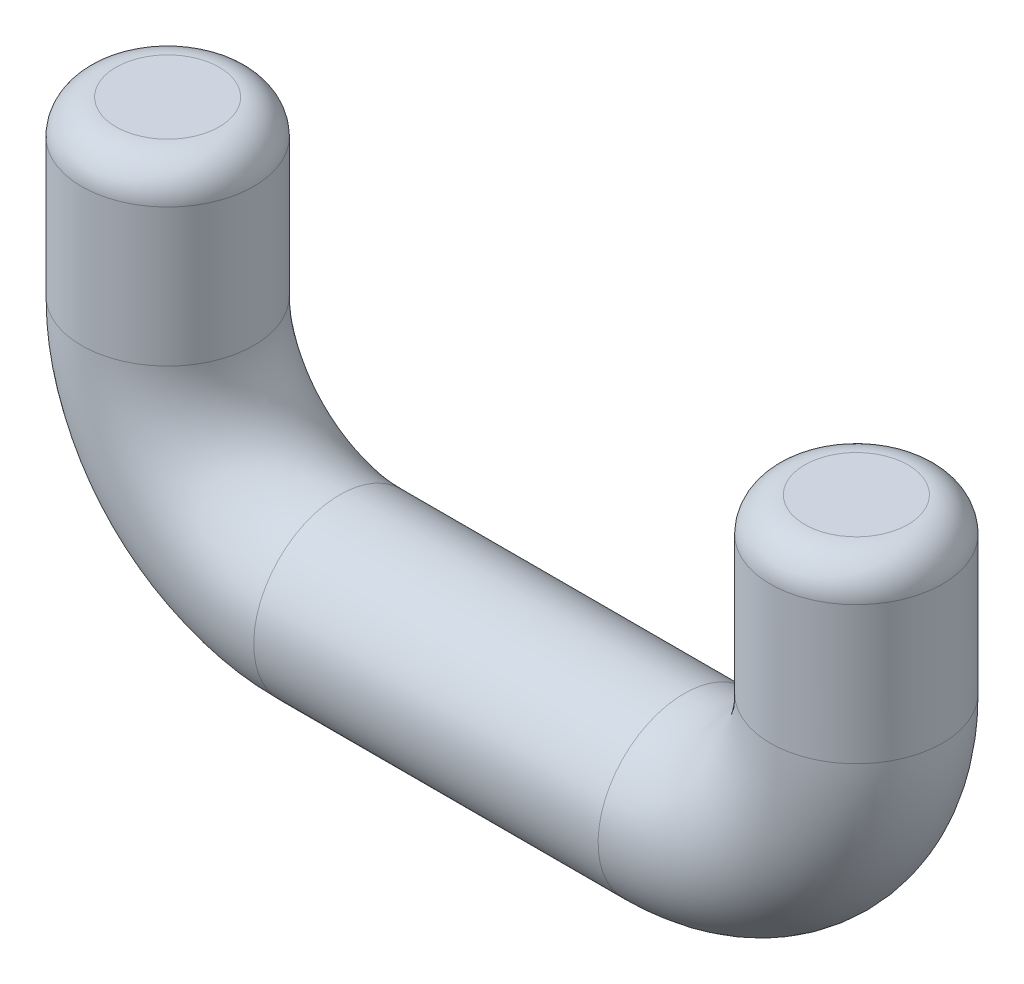
ISO-10303-21;
HEADER;
FILE_DESCRIPTION(('STEP AP214'),'2;1');
FILE_NAME('part.step','',(''),(''),'','','');
FILE_SCHEMA(('AUTOMOTIVE_DESIGN { 1 0 10303 214 1 1 1 1 }'));
ENDSEC;
DATA;
#1=APPLICATION_CONTEXT('core data for automotive mechanical design processes');
#2=APPLICATION_PROTOCOL_DEFINITION('international standard','automotive_design',2000,#1);
#3=PRODUCT_CONTEXT('',#1,'mechanical');
#4=PRODUCT('Part','Part','',(#3));
#5=PRODUCT_RELATED_PRODUCT_CATEGORY('part','',(#4));
#6=PRODUCT_DEFINITION_FORMATION('','',#4);
#7=PRODUCT_DEFINITION_CONTEXT('part definition',#1,'design');
#8=PRODUCT_DEFINITION('design','',#6,#7);
#9=PRODUCT_DEFINITION_SHAPE('','',#8);
#10=(LENGTH_UNIT() NAMED_UNIT(*) SI_UNIT(.MILLI.,.METRE.));
#11=(NAMED_UNIT(*) PLANE_ANGLE_UNIT() SI_UNIT($,.RADIAN.));
#12=(NAMED_UNIT(*) SI_UNIT($,.STERADIAN.) SOLID_ANGLE_UNIT());
#13=UNCERTAINTY_MEASURE_WITH_UNIT(LENGTH_MEASURE(1.E-05),#10,'distance_accuracy_value','');
#14=(GEOMETRIC_REPRESENTATION_CONTEXT(3) GLOBAL_UNCERTAINTY_ASSIGNED_CONTEXT((#13)) GLOBAL_UNIT_ASSIGNED_CONTEXT((#10,
#11,#12)) REPRESENTATION_CONTEXT('',''));
#15=CARTESIAN_POINT('',(0.,0.,0.));
#16=DIRECTION('',(0.,0.,1.));
#17=DIRECTION('',(1.,0.,0.));
#18=AXIS2_PLACEMENT_3D('',#15,#16,#17);
#19=CARTESIAN_POINT('',(20.,9.,0.));
#20=DIRECTION('',(0.,-1.,0.));
#21=DIRECTION('',(0.,0.,-1.));
#22=AXIS2_PLACEMENT_3D('',#19,#20,#21);
#23=TOROIDAL_SURFACE('',#22,1.5,1.);
#24=CARTESIAN_POINT('',(20.,10.,0.));
#25=DIRECTION('',(0.,-1.,0.));
#26=DIRECTION('',(0.,0.,-1.));
#27=AXIS2_PLACEMENT_3D('',#24,#25,#26);
#28=CIRCLE('',#27,1.5);
#29=CARTESIAN_POINT('',(20.,10.,-1.5));
#30=VERTEX_POINT('',#29);
#31=EDGE_CURVE('E37',#30,#30,#28,.F.);
#32=ORIENTED_EDGE('',*,*,#31,.F.);
#33=EDGE_LOOP('',(#32));
#34=FACE_BOUND('',#33,.T.);
#35=CARTESIAN_POINT('',(20.,9.,0.));
#36=DIRECTION('',(0.,-1.,0.));
#37=DIRECTION('',(0.,0.,-1.));
#38=AXIS2_PLACEMENT_3D('',#35,#36,#37);
#39=CIRCLE('',#38,2.5);
#40=CARTESIAN_POINT('',(20.,9.,-2.5));
#41=VERTEX_POINT('',#40);
#42=EDGE_CURVE('E10',#41,#41,#39,.T.);
#43=ORIENTED_EDGE('',*,*,#42,.F.);
#44=EDGE_LOOP('',(#43));
#45=FACE_BOUND('',#44,.T.);
#46=ADVANCED_FACE('F31',(#34,#45),#23,.T.);
#47=CARTESIAN_POINT('',(0.,9.,0.));
#48=DIRECTION('',(0.,1.,0.));
#49=DIRECTION('',(-1.,0.,0.));
#50=AXIS2_PLACEMENT_3D('',#47,#48,#49);
#51=TOROIDAL_SURFACE('',#50,1.5,1.);
#52=CARTESIAN_POINT('',(0.,10.,0.));
#53=DIRECTION('',(0.,1.,0.));
#54=DIRECTION('',(-1.,0.,0.));
#55=AXIS2_PLACEMENT_3D('',#52,#53,#54);
#56=CIRCLE('',#55,1.5);
#57=CARTESIAN_POINT('',(-1.5,10.,0.));
#58=VERTEX_POINT('',#57);
#59=EDGE_CURVE('E45',#58,#58,#56,.T.);
#60=ORIENTED_EDGE('',*,*,#59,.F.);
#61=EDGE_LOOP('',(#60));
#62=FACE_BOUND('',#61,.T.);
#63=CARTESIAN_POINT('',(0.,9.00000000000001,0.));
#64=DIRECTION('',(0.,1.,0.));
#65=DIRECTION('',(-1.,0.,0.));
#66=AXIS2_PLACEMENT_3D('',#63,#64,#65);
#67=CIRCLE('',#66,2.5);
#68=CARTESIAN_POINT('',(-2.5,9.00000000000001,0.));
#69=VERTEX_POINT('',#68);
#70=EDGE_CURVE('E41',#69,#69,#67,.F.);
#71=ORIENTED_EDGE('',*,*,#70,.F.);
#72=EDGE_LOOP('',(#71));
#73=FACE_BOUND('',#72,.T.);
#74=ADVANCED_FACE('F81',(#62,#73),#51,.T.);
#75=CARTESIAN_POINT('',(0.,5.,0.));
#76=DIRECTION('',(0.,1.,0.));
#77=DIRECTION('',(0.,0.,1.));
#78=AXIS2_PLACEMENT_3D('',#75,#76,#77);
#79=CYLINDRICAL_SURFACE('',#78,2.5);
#80=ORIENTED_EDGE('',*,*,#70,.T.);
#81=EDGE_LOOP('',(#80));
#82=FACE_BOUND('',#81,.T.);
#83=CARTESIAN_POINT('',(0.,5.,0.));
#84=DIRECTION('',(0.,1.,0.));
#85=DIRECTION('',(0.,0.,-1.));
#86=AXIS2_PLACEMENT_3D('',#83,#84,#85);
#87=CIRCLE('',#86,2.5);
#88=CARTESIAN_POINT('',(-2.5,5.,0.));
#89=VERTEX_POINT('',#88);
#90=EDGE_CURVE('E50',#89,#89,#87,.T.);
#91=ORIENTED_EDGE('',*,*,#90,.T.);
#92=EDGE_LOOP('',(#91));
#93=FACE_BOUND('',#92,.T.);
#94=ADVANCED_FACE('F86',(#82,#93),#79,.T.);
#95=CARTESIAN_POINT('',(5.,5.,0.));
#96=DIRECTION('',(0.,0.,-1.));
#97=DIRECTION('',(-1.,0.,0.));
#98=AXIS2_PLACEMENT_3D('',#95,#96,#97);
#99=TOROIDAL_SURFACE('',#98,5.,2.5);
#100=CARTESIAN_POINT('',(5.,0.,0.));
#101=DIRECTION('',(-1.,0.,0.));
#102=DIRECTION('',(0.,0.,-1.));
#103=AXIS2_PLACEMENT_3D('',#100,#101,#102);
#104=CIRCLE('',#103,2.5);
#105=CARTESIAN_POINT('',(5.,-2.5,0.));
#106=VERTEX_POINT('',#105);
#107=EDGE_CURVE('E53',#106,#106,#104,.T.);
#108=CARTESIAN_POINT('',(5.,5.,0.));
#109=DIRECTION('',(0.,0.,-1.));
#110=DIRECTION('',(-1.,0.,0.));
#111=AXIS2_PLACEMENT_3D('',#108,#109,#110);
#112=CIRCLE('',#111,7.5);
#113=EDGE_CURVE('',#106,#89,#112,.T.);
#114=ORIENTED_EDGE('',*,*,#107,.T.);
#115=ORIENTED_EDGE('',*,*,#90,.F.);
#116=ORIENTED_EDGE('',*,*,#113,.T.);
#117=ORIENTED_EDGE('',*,*,#113,.F.);
#118=EDGE_LOOP('',(#114,#116,#115,#117));
#119=FACE_BOUND('',#118,.T.);
#120=ADVANCED_FACE('F92',(#119),#99,.T.);
#121=CARTESIAN_POINT('',(15.,0.,0.));
#122=DIRECTION('',(-1.,0.,0.));
#123=DIRECTION('',(0.,-1.,0.));
#124=AXIS2_PLACEMENT_3D('',#121,#122,#123);
#125=CYLINDRICAL_SURFACE('',#124,2.5);
#126=CARTESIAN_POINT('',(15.,0.,0.));
#127=DIRECTION('',(-1.,0.,0.));
#128=DIRECTION('',(0.,0.,-1.));
#129=AXIS2_PLACEMENT_3D('',#126,#127,#128);
#130=CIRCLE('',#129,2.5);
#131=CARTESIAN_POINT('',(15.,-2.5,0.));
#132=VERTEX_POINT('',#131);
#133=EDGE_CURVE('E56',#132,#132,#130,.T.);
#134=ORIENTED_EDGE('',*,*,#133,.T.);
#135=EDGE_LOOP('',(#134));
#136=FACE_BOUND('',#135,.T.);
#137=ORIENTED_EDGE('',*,*,#107,.F.);
#138=EDGE_LOOP('',(#137));
#139=FACE_BOUND('',#138,.T.);
#140=ADVANCED_FACE('F77',(#136,#139),#125,.T.);
#141=CARTESIAN_POINT('',(15.,5.,0.));
#142=DIRECTION('',(0.,0.,-1.));
#143=DIRECTION('',(-1.,0.,0.));
#144=AXIS2_PLACEMENT_3D('',#141,#142,#143);
#145=TOROIDAL_SURFACE('',#144,5.,2.5);
#146=CARTESIAN_POINT('',(20.,5.,0.));
#147=DIRECTION('',(0.,-1.,0.));
#148=DIRECTION('',(0.,0.,-1.));
#149=AXIS2_PLACEMENT_3D('',#146,#147,#148);
#150=CIRCLE('',#149,2.5);
#151=CARTESIAN_POINT('',(22.5,4.99999999999999,0.));
#152=VERTEX_POINT('',#151);
#153=EDGE_CURVE('E59',#152,#152,#150,.T.);
#154=CARTESIAN_POINT('',(15.,5.,0.));
#155=DIRECTION('',(0.,0.,-1.));
#156=DIRECTION('',(-1.,0.,0.));
#157=AXIS2_PLACEMENT_3D('',#154,#155,#156);
#158=CIRCLE('',#157,7.5);
#159=EDGE_CURVE('',#152,#132,#158,.T.);
#160=ORIENTED_EDGE('',*,*,#153,.T.);
#161=ORIENTED_EDGE('',*,*,#133,.F.);
#162=ORIENTED_EDGE('',*,*,#159,.T.);
#163=ORIENTED_EDGE('',*,*,#159,.F.);
#164=EDGE_LOOP('',(#160,#162,#161,#163));
#165=FACE_BOUND('',#164,.T.);
#166=ADVANCED_FACE('F63',(#165),#145,.T.);
#167=CARTESIAN_POINT('',(20.,5.,0.));
#168=DIRECTION('',(0.,1.,0.));
#169=DIRECTION('',(-1.,0.,0.));
#170=AXIS2_PLACEMENT_3D('',#167,#168,#169);
#171=CYLINDRICAL_SURFACE('',#170,2.5);
#172=ORIENTED_EDGE('',*,*,#42,.T.);
#173=EDGE_LOOP('',(#172));
#174=FACE_BOUND('',#173,.T.);
#175=ORIENTED_EDGE('',*,*,#153,.F.);
#176=EDGE_LOOP('',(#175));
#177=FACE_BOUND('',#176,.T.);
#178=ADVANCED_FACE('F66',(#174,#177),#171,.T.);
#179=CARTESIAN_POINT('',(0.,10.,0.));
#180=DIRECTION('',(0.,1.,0.));
#181=DIRECTION('',(0.,0.,-1.));
#182=AXIS2_PLACEMENT_3D('',#179,#180,#181);
#183=PLANE('',#182);
#184=ORIENTED_EDGE('',*,*,#59,.T.);
#185=EDGE_LOOP('',(#184));
#186=FACE_BOUND('',#185,.T.);
#187=ADVANCED_FACE('F68',(#186),#183,.T.);
#188=CARTESIAN_POINT('',(20.,10.,0.));
#189=DIRECTION('',(0.,-1.,0.));
#190=DIRECTION('',(0.,0.,-1.));
#191=AXIS2_PLACEMENT_3D('',#188,#189,#190);
#192=PLANE('',#191);
#193=ORIENTED_EDGE('',*,*,#31,.T.);
#194=EDGE_LOOP('',(#193));
#195=FACE_BOUND('',#194,.T.);
#196=ADVANCED_FACE('F74',(#195),#192,.F.);
#197=CLOSED_SHELL('',(#46,#74,#94,#120,#140,#166,#178,#187,#196));
#198=MANIFOLD_SOLID_BREP('B2',#197);
#199=ADVANCED_BREP_SHAPE_REPRESENTATION('',(#18,#198),#14);
#200=SHAPE_DEFINITION_REPRESENTATION(#9,#199);
ENDSEC;
END-ISO-10303-21;
